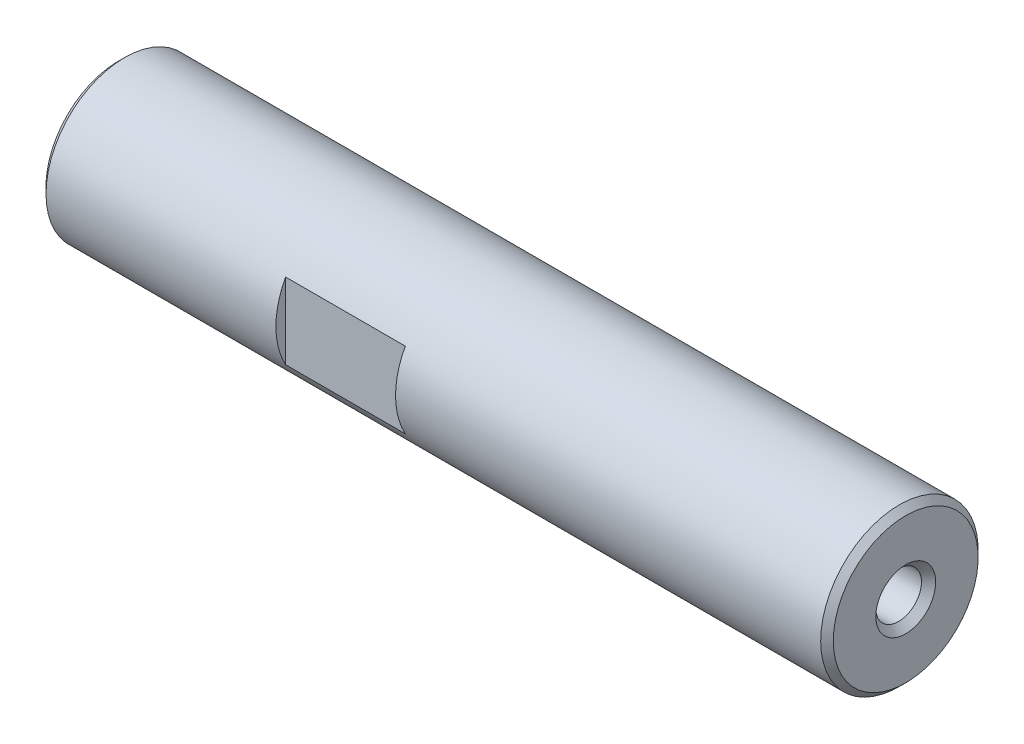
ISO-10303-21;
HEADER;
FILE_DESCRIPTION(('STEP AP214'),'2;1');
FILE_NAME('part.step','',(''),(''),'','','');
FILE_SCHEMA(('AUTOMOTIVE_DESIGN { 1 0 10303 214 1 1 1 1 }'));
ENDSEC;
DATA;
#1=APPLICATION_CONTEXT('core data for automotive mechanical design processes');
#2=APPLICATION_PROTOCOL_DEFINITION('international standard','automotive_design',2000,#1);
#3=PRODUCT_CONTEXT('',#1,'mechanical');
#4=PRODUCT('Part','Part','',(#3));
#5=PRODUCT_RELATED_PRODUCT_CATEGORY('part','',(#4));
#6=PRODUCT_DEFINITION_FORMATION('','',#4);
#7=PRODUCT_DEFINITION_CONTEXT('part definition',#1,'design');
#8=PRODUCT_DEFINITION('design','',#6,#7);
#9=PRODUCT_DEFINITION_SHAPE('','',#8);
#10=(LENGTH_UNIT() NAMED_UNIT(*) SI_UNIT(.MILLI.,.METRE.));
#11=(NAMED_UNIT(*) PLANE_ANGLE_UNIT() SI_UNIT($,.RADIAN.));
#12=(NAMED_UNIT(*) SI_UNIT($,.STERADIAN.) SOLID_ANGLE_UNIT());
#13=UNCERTAINTY_MEASURE_WITH_UNIT(LENGTH_MEASURE(1.E-05),#10,'distance_accuracy_value','');
#14=(GEOMETRIC_REPRESENTATION_CONTEXT(3) GLOBAL_UNCERTAINTY_ASSIGNED_CONTEXT((#13)) GLOBAL_UNIT_ASSIGNED_CONTEXT((#10,
#11,#12)) REPRESENTATION_CONTEXT('',''));
#15=CARTESIAN_POINT('',(0.,0.,0.));
#16=DIRECTION('',(0.,0.,1.));
#17=DIRECTION('',(1.,0.,0.));
#18=AXIS2_PLACEMENT_3D('',#15,#16,#17);
#19=CARTESIAN_POINT('',(51.9175999999675,0.,0.));
#20=DIRECTION('',(1.,0.,0.));
#21=DIRECTION('',(0.,1.,0.));
#22=AXIS2_PLACEMENT_3D('',#19,#20,#21);
#23=CONICAL_SURFACE('',#22,1.84022999991384,1.04719755108309);
#24=CARTESIAN_POINT('',(50.855142714056,0.,1.13686837721616E-10));
#25=VERTEX_POINT('',#24);
#26=VERTEX_LOOP('',#25);
#27=FACE_BOUND('',#26,.T.);
#28=CARTESIAN_POINT('',(51.9176,0.,0.));
#29=DIRECTION('',(-1.,0.,0.));
#30=DIRECTION('',(0.,0.,1.));
#31=AXIS2_PLACEMENT_3D('',#28,#29,#30);
#32=CIRCLE('',#31,1.84023);
#33=CARTESIAN_POINT('',(51.9176,0.,1.84023));
#34=VERTEX_POINT('',#33);
#35=EDGE_CURVE('E114',#34,#34,#32,.F.);
#36=ORIENTED_EDGE('',*,*,#35,.T.);
#37=EDGE_LOOP('',(#36));
#38=FACE_BOUND('',#37,.T.);
#39=ADVANCED_FACE('F17',(#27,#38),#23,.F.);
#40=CARTESIAN_POINT('',(11.5824000001226,0.,0.));
#41=DIRECTION('',(-1.,0.,0.));
#42=DIRECTION('',(0.,0.,1.));
#43=AXIS2_PLACEMENT_3D('',#40,#41,#42);
#44=CONICAL_SURFACE('',#43,1.84022999974331,1.0471975510893);
#45=CARTESIAN_POINT('',(12.6448572859204,0.,1.13686837721616E-10));
#46=VERTEX_POINT('',#45);
#47=VERTEX_LOOP('',#46);
#48=FACE_BOUND('',#47,.T.);
#49=CARTESIAN_POINT('',(11.5824,0.,0.));
#50=DIRECTION('',(-1.,0.,0.));
#51=DIRECTION('',(0.,0.,1.));
#52=AXIS2_PLACEMENT_3D('',#49,#50,#51);
#53=CIRCLE('',#52,1.84023);
#54=CARTESIAN_POINT('',(11.5824,0.,1.84023));
#55=VERTEX_POINT('',#54);
#56=EDGE_CURVE('E105',#55,#55,#53,.T.);
#57=ORIENTED_EDGE('',*,*,#56,.T.);
#58=EDGE_LOOP('',(#57));
#59=FACE_BOUND('',#58,.T.);
#60=ADVANCED_FACE('F285',(#48,#59),#44,.F.);
#61=CARTESIAN_POINT('',(57.422415,0.,0.));
#62=DIRECTION('',(-1.,0.,0.));
#63=DIRECTION('',(0.,0.,1.));
#64=AXIS2_PLACEMENT_3D('',#61,#62,#63);
#65=CYLINDRICAL_SURFACE('',#64,1.84023);
#66=CARTESIAN_POINT('',(62.9272300000139,0.,0.));
#67=DIRECTION('',(1.,0.,0.));
#68=DIRECTION('',(0.,0.,-1.));
#69=AXIS2_PLACEMENT_3D('',#66,#67,#68);
#70=CIRCLE('',#69,1.84023000002753);
#71=CARTESIAN_POINT('',(62.9272300000139,0.,-1.84023000002753));
#72=VERTEX_POINT('',#71);
#73=EDGE_CURVE('E100',#72,#72,#70,.T.);
#74=ORIENTED_EDGE('',*,*,#73,.T.);
#75=EDGE_LOOP('',(#74));
#76=FACE_BOUND('',#75,.T.);
#77=ORIENTED_EDGE('',*,*,#35,.F.);
#78=EDGE_LOOP('',(#77));
#79=FACE_BOUND('',#78,.T.);
#80=ADVANCED_FACE('F276',(#76,#79),#65,.F.);
#81=CARTESIAN_POINT('',(6.077585,0.,0.));
#82=DIRECTION('',(-1.,0.,0.));
#83=DIRECTION('',(0.,0.,1.));
#84=AXIS2_PLACEMENT_3D('',#81,#82,#83);
#85=CYLINDRICAL_SURFACE('',#84,1.84023);
#86=ORIENTED_EDGE('',*,*,#56,.F.);
#87=EDGE_LOOP('',(#86));
#88=FACE_BOUND('',#87,.T.);
#89=CARTESIAN_POINT('',(0.572770000019318,0.,0.));
#90=DIRECTION('',(-1.,0.,0.));
#91=DIRECTION('',(0.,0.,-1.));
#92=AXIS2_PLACEMENT_3D('',#89,#90,#91);
#93=CIRCLE('',#92,1.84022999997069);
#94=CARTESIAN_POINT('',(0.572770000019318,0.,-1.84022999997069));
#95=VERTEX_POINT('',#94);
#96=EDGE_CURVE('E96',#95,#95,#93,.T.);
#97=ORIENTED_EDGE('',*,*,#96,.T.);
#98=EDGE_LOOP('',(#97));
#99=FACE_BOUND('',#98,.T.);
#100=ADVANCED_FACE('F267',(#88,#99),#85,.F.);
#101=CARTESIAN_POINT('',(63.50000000009,0.,0.));
#102=DIRECTION('',(1.,0.,0.));
#103=DIRECTION('',(0.,0.,-1.));
#104=AXIS2_PLACEMENT_3D('',#101,#102,#103);
#105=CONICAL_SURFACE('',#104,2.41300000010369,0.785398163397448);
#106=CARTESIAN_POINT('',(63.5000000000332,0.,0.));
#107=DIRECTION('',(1.,0.,0.));
#108=DIRECTION('',(0.,0.,-1.));
#109=AXIS2_PLACEMENT_3D('',#106,#107,#108);
#110=CIRCLE('',#109,2.41300000004685);
#111=CARTESIAN_POINT('',(63.5000000000332,0.,-2.41300000004685));
#112=VERTEX_POINT('',#111);
#113=EDGE_CURVE('E20',#112,#112,#110,.F.);
#114=ORIENTED_EDGE('',*,*,#113,.F.);
#115=EDGE_LOOP('',(#114));
#116=FACE_BOUND('',#115,.T.);
#117=ORIENTED_EDGE('',*,*,#73,.F.);
#118=EDGE_LOOP('',(#117));
#119=FACE_BOUND('',#118,.T.);
#120=ADVANCED_FACE('F258',(#116,#119),#105,.F.);
#121=CARTESIAN_POINT('',(0.,0.,0.));
#122=DIRECTION('',(-1.,0.,0.));
#123=DIRECTION('',(0.,0.,1.));
#124=AXIS2_PLACEMENT_3D('',#121,#122,#123);
#125=CONICAL_SURFACE('',#124,2.41299999999001,0.785398163397448);
#126=ORIENTED_EDGE('',*,*,#96,.F.);
#127=EDGE_LOOP('',(#126));
#128=FACE_BOUND('',#127,.T.);
#129=CARTESIAN_POINT('',(0.,0.,0.));
#130=DIRECTION('',(-1.,0.,0.));
#131=DIRECTION('',(0.,0.,1.));
#132=AXIS2_PLACEMENT_3D('',#129,#130,#131);
#133=CIRCLE('',#132,2.41299999999001);
#134=CARTESIAN_POINT('',(0.,0.,2.41299999999001));
#135=VERTEX_POINT('',#134);
#136=EDGE_CURVE('E91',#135,#135,#133,.F.);
#137=ORIENTED_EDGE('',*,*,#136,.F.);
#138=EDGE_LOOP('',(#137));
#139=FACE_BOUND('',#138,.T.);
#140=ADVANCED_FACE('F250',(#128,#139),#125,.F.);
#141=CARTESIAN_POINT('',(63.5,2.921,0.));
#142=DIRECTION('',(1.,0.,0.));
#143=DIRECTION('',(0.,0.,-1.));
#144=AXIS2_PLACEMENT_3D('',#141,#142,#143);
#145=PLANE('',#144);
#146=ORIENTED_EDGE('',*,*,#113,.T.);
#147=EDGE_LOOP('',(#146));
#148=FACE_BOUND('',#147,.T.);
#149=CARTESIAN_POINT('',(63.5000000000332,0.,0.));
#150=DIRECTION('',(-1.,0.,0.));
#151=DIRECTION('',(0.,0.,1.));
#152=AXIS2_PLACEMENT_3D('',#149,#150,#151);
#153=CIRCLE('',#152,5.84199999991597);
#154=CARTESIAN_POINT('',(63.5000000000332,0.,5.84199999991597));
#155=VERTEX_POINT('',#154);
#156=EDGE_CURVE('E89',#155,#155,#153,.T.);
#157=ORIENTED_EDGE('',*,*,#156,.F.);
#158=EDGE_LOOP('',(#157));
#159=FACE_BOUND('',#158,.T.);
#160=ADVANCED_FACE('F242',(#148,#159),#145,.T.);
#161=CARTESIAN_POINT('',(0.,2.921,0.));
#162=DIRECTION('',(-1.,0.,0.));
#163=DIRECTION('',(0.,0.,1.));
#164=AXIS2_PLACEMENT_3D('',#161,#162,#163);
#165=PLANE('',#164);
#166=ORIENTED_EDGE('',*,*,#136,.T.);
#167=EDGE_LOOP('',(#166));
#168=FACE_BOUND('',#167,.T.);
#169=CARTESIAN_POINT('',(5.68433104405908E-11,0.,0.));
#170=DIRECTION('',(1.,0.,0.));
#171=DIRECTION('',(0.,0.,-1.));
#172=AXIS2_PLACEMENT_3D('',#169,#170,#171);
#173=CIRCLE('',#172,5.84200000002966);
#174=CARTESIAN_POINT('',(5.68433104405908E-11,0.,-5.84200000002966));
#175=VERTEX_POINT('',#174);
#176=EDGE_CURVE('E67',#175,#175,#173,.T.);
#177=ORIENTED_EDGE('',*,*,#176,.F.);
#178=EDGE_LOOP('',(#177));
#179=FACE_BOUND('',#178,.T.);
#180=ADVANCED_FACE('F157',(#168,#179),#165,.T.);
#181=CARTESIAN_POINT('',(62.9920000000652,0.,0.));
#182=DIRECTION('',(-1.,0.,0.));
#183=DIRECTION('',(0.,0.,1.));
#184=AXIS2_PLACEMENT_3D('',#181,#182,#183);
#185=CONICAL_SURFACE('',#184,6.34999999994079,0.785398163453397);
#186=CARTESIAN_POINT('',(62.992,0.,0.));
#187=DIRECTION('',(-1.,0.,0.));
#188=DIRECTION('',(0.,0.,1.));
#189=AXIS2_PLACEMENT_3D('',#186,#187,#188);
#190=CIRCLE('',#189,6.35);
#191=CARTESIAN_POINT('',(62.992,0.,6.35));
#192=VERTEX_POINT('',#191);
#193=EDGE_CURVE('E134',#192,#192,#190,.T.);
#194=ORIENTED_EDGE('',*,*,#193,.F.);
#195=EDGE_LOOP('',(#194));
#196=FACE_BOUND('',#195,.T.);
#197=ORIENTED_EDGE('',*,*,#156,.T.);
#198=EDGE_LOOP('',(#197));
#199=FACE_BOUND('',#198,.T.);
#200=ADVANCED_FACE('F148',(#196,#199),#185,.T.);
#201=CARTESIAN_POINT('',(0.507999999911135,0.,0.));
#202=DIRECTION('',(1.,0.,0.));
#203=DIRECTION('',(0.,0.,-1.));
#204=AXIS2_PLACEMENT_3D('',#201,#202,#203);
#205=CONICAL_SURFACE('',#204,6.34999999994079,0.785398163453397);
#206=ORIENTED_EDGE('',*,*,#176,.T.);
#207=EDGE_LOOP('',(#206));
#208=FACE_BOUND('',#207,.T.);
#209=CARTESIAN_POINT('',(0.508000000000002,0.,0.));
#210=DIRECTION('',(-1.,0.,0.));
#211=DIRECTION('',(0.,0.,1.));
#212=AXIS2_PLACEMENT_3D('',#209,#210,#211);
#213=CIRCLE('',#212,6.35);
#214=CARTESIAN_POINT('',(0.508000000000002,0.,6.35));
#215=VERTEX_POINT('',#214);
#216=EDGE_CURVE('E82',#215,#215,#213,.F.);
#217=ORIENTED_EDGE('',*,*,#216,.F.);
#218=EDGE_LOOP('',(#217));
#219=FACE_BOUND('',#218,.T.);
#220=ADVANCED_FACE('F146',(#208,#219),#205,.T.);
#221=CARTESIAN_POINT('',(19.05,0.,0.));
#222=DIRECTION('',(1.,0.,0.));
#223=DIRECTION('',(0.,0.,-1.));
#224=AXIS2_PLACEMENT_3D('',#221,#222,#223);
#225=PLANE('',#224);
#226=CARTESIAN_POINT('',(19.05,0.,0.));
#227=DIRECTION('',(-1.,0.,0.));
#228=DIRECTION('',(0.,0.,1.));
#229=AXIS2_PLACEMENT_3D('',#226,#227,#228);
#230=CIRCLE('',#229,6.35);
#231=CARTESIAN_POINT('',(19.05,3.06267550354261,-5.5626));
#232=VERTEX_POINT('',#231);
#233=CARTESIAN_POINT('',(19.05,-3.06267550354261,-5.5626));
#234=VERTEX_POINT('',#233);
#235=EDGE_CURVE('E64',#232,#234,#230,.T.);
#236=ORIENTED_EDGE('',*,*,#235,.F.);
#237=DIRECTION('',(0.,1.,0.));
#238=VECTOR('',#237,1.);
#239=CARTESIAN_POINT('',(19.05,-12.7,-5.5626));
#240=LINE('',#239,#238);
#241=EDGE_CURVE('E59',#232,#234,#240,.F.);
#242=ORIENTED_EDGE('',*,*,#241,.T.);
#243=EDGE_LOOP('',(#236,#242));
#244=FACE_BOUND('',#243,.T.);
#245=ADVANCED_FACE('F62',(#244),#225,.T.);
#246=CARTESIAN_POINT('',(19.05,-12.7,-5.5626));
#247=DIRECTION('',(0.,0.,1.));
#248=DIRECTION('',(1.,0.,0.));
#249=AXIS2_PLACEMENT_3D('',#246,#247,#248);
#250=PLANE('',#249);
#251=ORIENTED_EDGE('',*,*,#241,.F.);
#252=DIRECTION('',(-1.,0.,0.));
#253=VECTOR('',#252,1.);
#254=CARTESIAN_POINT('',(31.75,3.06267550354261,-5.5626));
#255=LINE('',#254,#253);
#256=CARTESIAN_POINT('',(28.702,3.06267550354261,-5.5626));
#257=VERTEX_POINT('',#256);
#258=EDGE_CURVE('E80',#257,#232,#255,.T.);
#259=ORIENTED_EDGE('',*,*,#258,.F.);
#260=DIRECTION('',(0.,1.,0.));
#261=VECTOR('',#260,1.);
#262=CARTESIAN_POINT('',(28.702,0.,-5.5626));
#263=LINE('',#262,#261);
#264=CARTESIAN_POINT('',(28.702,-3.06267550354261,-5.5626));
#265=VERTEX_POINT('',#264);
#266=EDGE_CURVE('E66',#257,#265,#263,.F.);
#267=ORIENTED_EDGE('',*,*,#266,.T.);
#268=DIRECTION('',(-1.,0.,0.));
#269=VECTOR('',#268,1.);
#270=CARTESIAN_POINT('',(31.75,-3.06267550354261,-5.5626));
#271=LINE('',#270,#269);
#272=EDGE_CURVE('E70',#234,#265,#271,.F.);
#273=ORIENTED_EDGE('',*,*,#272,.F.);
#274=EDGE_LOOP('',(#251,#259,#267,#273));
#275=FACE_BOUND('',#274,.T.);
#276=ADVANCED_FACE('F71',(#275),#250,.F.);
#277=CARTESIAN_POINT('',(28.702,0.,0.));
#278=DIRECTION('',(1.,0.,0.));
#279=DIRECTION('',(0.,0.,-1.));
#280=AXIS2_PLACEMENT_3D('',#277,#278,#279);
#281=PLANE('',#280);
#282=ORIENTED_EDGE('',*,*,#266,.F.);
#283=CARTESIAN_POINT('',(28.702,0.,0.));
#284=DIRECTION('',(-1.,0.,0.));
#285=DIRECTION('',(0.,0.,1.));
#286=AXIS2_PLACEMENT_3D('',#283,#284,#285);
#287=CIRCLE('',#286,6.35);
#288=EDGE_CURVE('E76',#265,#257,#287,.F.);
#289=ORIENTED_EDGE('',*,*,#288,.F.);
#290=EDGE_LOOP('',(#282,#289));
#291=FACE_BOUND('',#290,.T.);
#292=ADVANCED_FACE('F175',(#291),#281,.F.);
#293=CARTESIAN_POINT('',(19.05,0.,0.));
#294=DIRECTION('',(1.,0.,0.));
#295=DIRECTION('',(0.,0.,-1.));
#296=AXIS2_PLACEMENT_3D('',#293,#294,#295);
#297=PLANE('',#296);
#298=CARTESIAN_POINT('',(19.05,0.,0.));
#299=DIRECTION('',(-1.,0.,0.));
#300=DIRECTION('',(0.,0.,1.));
#301=AXIS2_PLACEMENT_3D('',#298,#299,#300);
#302=CIRCLE('',#301,6.35);
#303=CARTESIAN_POINT('',(19.05,-3.06267550354261,5.5626));
#304=VERTEX_POINT('',#303);
#305=CARTESIAN_POINT('',(19.05,3.06267550354261,5.5626));
#306=VERTEX_POINT('',#305);
#307=EDGE_CURVE('E120',#304,#306,#302,.T.);
#308=ORIENTED_EDGE('',*,*,#307,.F.);
#309=DIRECTION('',(0.,1.,0.));
#310=VECTOR('',#309,1.);
#311=CARTESIAN_POINT('',(19.05,12.7,5.5626));
#312=LINE('',#311,#310);
#313=EDGE_CURVE('E131',#304,#306,#312,.T.);
#314=ORIENTED_EDGE('',*,*,#313,.T.);
#315=EDGE_LOOP('',(#308,#314));
#316=FACE_BOUND('',#315,.T.);
#317=ADVANCED_FACE('F172',(#316),#297,.T.);
#318=CARTESIAN_POINT('',(19.05,12.7,5.5626));
#319=DIRECTION('',(0.,0.,-1.));
#320=DIRECTION('',(-1.,0.,0.));
#321=AXIS2_PLACEMENT_3D('',#318,#319,#320);
#322=PLANE('',#321);
#323=ORIENTED_EDGE('',*,*,#313,.F.);
#324=DIRECTION('',(-1.,0.,0.));
#325=VECTOR('',#324,1.);
#326=CARTESIAN_POINT('',(31.75,-3.06267550354261,5.5626));
#327=LINE('',#326,#325);
#328=CARTESIAN_POINT('',(28.702,-3.06267550354261,5.5626));
#329=VERTEX_POINT('',#328);
#330=EDGE_CURVE('E122',#329,#304,#327,.T.);
#331=ORIENTED_EDGE('',*,*,#330,.F.);
#332=DIRECTION('',(0.,1.,0.));
#333=VECTOR('',#332,1.);
#334=CARTESIAN_POINT('',(28.702,0.,5.5626));
#335=LINE('',#334,#333);
#336=CARTESIAN_POINT('',(28.702,3.06267550354261,5.5626));
#337=VERTEX_POINT('',#336);
#338=EDGE_CURVE('E35',#329,#337,#335,.T.);
#339=ORIENTED_EDGE('',*,*,#338,.T.);
#340=DIRECTION('',(-1.,0.,0.));
#341=VECTOR('',#340,1.);
#342=CARTESIAN_POINT('',(31.75,3.06267550354261,5.5626));
#343=LINE('',#342,#341);
#344=EDGE_CURVE('E26',#306,#337,#343,.F.);
#345=ORIENTED_EDGE('',*,*,#344,.F.);
#346=EDGE_LOOP('',(#323,#331,#339,#345));
#347=FACE_BOUND('',#346,.T.);
#348=ADVANCED_FACE('F166',(#347),#322,.F.);
#349=CARTESIAN_POINT('',(28.702,0.,0.));
#350=DIRECTION('',(1.,0.,0.));
#351=DIRECTION('',(0.,0.,-1.));
#352=AXIS2_PLACEMENT_3D('',#349,#350,#351);
#353=PLANE('',#352);
#354=ORIENTED_EDGE('',*,*,#338,.F.);
#355=CARTESIAN_POINT('',(28.702,0.,0.));
#356=DIRECTION('',(-1.,0.,0.));
#357=DIRECTION('',(0.,0.,1.));
#358=AXIS2_PLACEMENT_3D('',#355,#356,#357);
#359=CIRCLE('',#358,6.35);
#360=EDGE_CURVE('E11',#337,#329,#359,.F.);
#361=ORIENTED_EDGE('',*,*,#360,.F.);
#362=EDGE_LOOP('',(#354,#361));
#363=FACE_BOUND('',#362,.T.);
#364=ADVANCED_FACE('F161',(#363),#353,.F.);
#365=CARTESIAN_POINT('',(31.75,0.,0.));
#366=DIRECTION('',(-1.,0.,0.));
#367=DIRECTION('',(0.,0.,1.));
#368=AXIS2_PLACEMENT_3D('',#365,#366,#367);
#369=CYLINDRICAL_SURFACE('',#368,6.35);
#370=ORIENTED_EDGE('',*,*,#344,.T.);
#371=ORIENTED_EDGE('',*,*,#360,.T.);
#372=ORIENTED_EDGE('',*,*,#330,.T.);
#373=ORIENTED_EDGE('',*,*,#307,.T.);
#374=EDGE_LOOP('',(#370,#371,#372,#373));
#375=FACE_BOUND('',#374,.T.);
#376=ORIENTED_EDGE('',*,*,#272,.T.);
#377=ORIENTED_EDGE('',*,*,#288,.T.);
#378=ORIENTED_EDGE('',*,*,#258,.T.);
#379=ORIENTED_EDGE('',*,*,#235,.T.);
#380=EDGE_LOOP('',(#376,#377,#378,#379));
#381=FACE_BOUND('',#380,.T.);
#382=ORIENTED_EDGE('',*,*,#216,.T.);
#383=EDGE_LOOP('',(#382));
#384=FACE_BOUND('',#383,.T.);
#385=ORIENTED_EDGE('',*,*,#193,.T.);
#386=EDGE_LOOP('',(#385));
#387=FACE_BOUND('',#386,.T.);
#388=ADVANCED_FACE('F78',(#375,#381,#384,#387),#369,.T.);
#389=CLOSED_SHELL('',(#39,#60,#80,#100,#120,#140,#160,#180,#200,#220,#245,#276,#292,#317,#348,
#364,#388));
#390=MANIFOLD_SOLID_BREP('B1',#389);
#391=ADVANCED_BREP_SHAPE_REPRESENTATION('',(#18,#390),#14);
#392=SHAPE_DEFINITION_REPRESENTATION(#9,#391);
ENDSEC;
END-ISO-10303-21;
